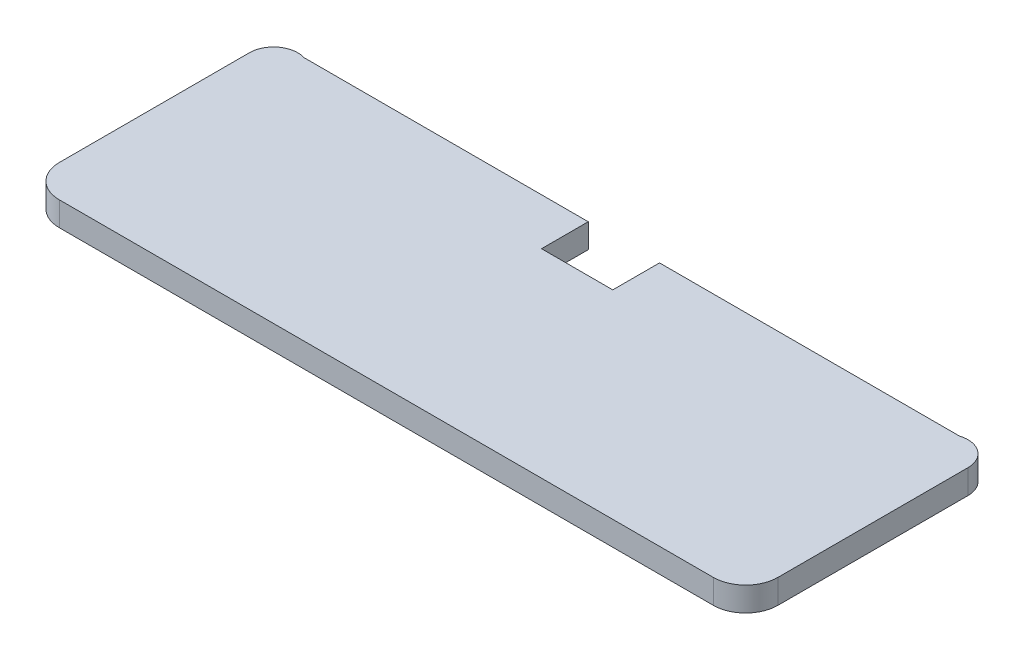
ISO-10303-21;
HEADER;
FILE_DESCRIPTION(('STEP AP214'),'2;1');
FILE_NAME('part.step','',(''),(''),'','','');
FILE_SCHEMA(('AUTOMOTIVE_DESIGN { 1 0 10303 214 1 1 1 1 }'));
ENDSEC;
DATA;
#1=APPLICATION_CONTEXT('core data for automotive mechanical design processes');
#2=APPLICATION_PROTOCOL_DEFINITION('international standard','automotive_design',2000,#1);
#3=PRODUCT_CONTEXT('',#1,'mechanical');
#4=PRODUCT('Part','Part','',(#3));
#5=PRODUCT_RELATED_PRODUCT_CATEGORY('part','',(#4));
#6=PRODUCT_DEFINITION_FORMATION('','',#4);
#7=PRODUCT_DEFINITION_CONTEXT('part definition',#1,'design');
#8=PRODUCT_DEFINITION('design','',#6,#7);
#9=PRODUCT_DEFINITION_SHAPE('','',#8);
#10=(LENGTH_UNIT() NAMED_UNIT(*) SI_UNIT(.MILLI.,.METRE.));
#11=(NAMED_UNIT(*) PLANE_ANGLE_UNIT() SI_UNIT($,.RADIAN.));
#12=(NAMED_UNIT(*) SI_UNIT($,.STERADIAN.) SOLID_ANGLE_UNIT());
#13=UNCERTAINTY_MEASURE_WITH_UNIT(LENGTH_MEASURE(1.E-05),#10,'distance_accuracy_value','');
#14=(GEOMETRIC_REPRESENTATION_CONTEXT(3) GLOBAL_UNCERTAINTY_ASSIGNED_CONTEXT((#13)) GLOBAL_UNIT_ASSIGNED_CONTEXT((#10,
#11,#12)) REPRESENTATION_CONTEXT('',''));
#15=CARTESIAN_POINT('',(0.,0.,0.));
#16=DIRECTION('',(0.,0.,1.));
#17=DIRECTION('',(1.,0.,0.));
#18=AXIS2_PLACEMENT_3D('',#15,#16,#17);
#19=CARTESIAN_POINT('',(37.0635696102086,3.,9.91666470047658));
#20=DIRECTION('',(0.,-1.,0.));
#21=DIRECTION('',(0.,0.,-1.));
#22=AXIS2_PLACEMENT_3D('',#19,#20,#21);
#23=CYLINDRICAL_SURFACE('',#22,4.);
#24=CARTESIAN_POINT('',(37.0635696102086,0.,9.91666470047658));
#25=DIRECTION('',(0.,1.,0.));
#26=DIRECTION('',(0.,0.,-1.));
#27=AXIS2_PLACEMENT_3D('',#24,#25,#26);
#28=CIRCLE('',#27,4.);
#29=CARTESIAN_POINT('',(37.0635696102086,0.,13.9166647004766));
#30=VERTEX_POINT('',#29);
#31=CARTESIAN_POINT('',(41.0635696102086,0.,9.91666470047655));
#32=VERTEX_POINT('',#31);
#33=EDGE_CURVE('E151',#30,#32,#28,.T.);
#34=ORIENTED_EDGE('',*,*,#33,.T.);
#35=DIRECTION('',(0.,-1.,0.));
#36=VECTOR('',#35,1.);
#37=CARTESIAN_POINT('',(41.0635696102086,3.,9.91666470047655));
#38=LINE('',#37,#36);
#39=CARTESIAN_POINT('',(41.0635696102086,3.,9.91666470047655));
#40=VERTEX_POINT('',#39);
#41=EDGE_CURVE('E11',#40,#32,#38,.T.);
#42=ORIENTED_EDGE('',*,*,#41,.F.);
#43=CARTESIAN_POINT('',(37.0635696102086,3.,9.91666470047658));
#44=DIRECTION('',(0.,1.,0.));
#45=DIRECTION('',(0.,0.,-1.));
#46=AXIS2_PLACEMENT_3D('',#43,#44,#45);
#47=CIRCLE('',#46,4.);
#48=CARTESIAN_POINT('',(37.0635696102086,3.,13.9166647004766));
#49=VERTEX_POINT('',#48);
#50=EDGE_CURVE('E174',#49,#40,#47,.T.);
#51=ORIENTED_EDGE('',*,*,#50,.F.);
#52=DIRECTION('',(0.,-1.,0.));
#53=VECTOR('',#52,1.);
#54=CARTESIAN_POINT('',(37.0635696102086,3.,13.9166647004766));
#55=LINE('',#54,#53);
#56=EDGE_CURVE('E147',#49,#30,#55,.T.);
#57=ORIENTED_EDGE('',*,*,#56,.T.);
#58=EDGE_LOOP('',(#34,#42,#51,#57));
#59=FACE_BOUND('',#58,.T.);
#60=ADVANCED_FACE('F32',(#59),#23,.T.);
#61=CARTESIAN_POINT('',(41.0635696102087,3.,-13.6227273136929));
#62=DIRECTION('',(-1.,0.,0.));
#63=DIRECTION('',(0.,0.,1.));
#64=AXIS2_PLACEMENT_3D('',#61,#62,#63);
#65=PLANE('',#64);
#66=DIRECTION('',(0.,0.,-1.));
#67=VECTOR('',#66,1.);
#68=CARTESIAN_POINT('',(41.0635696102087,0.,-13.6227273136929));
#69=LINE('',#68,#67);
#70=CARTESIAN_POINT('',(41.0635696102087,0.,-13.6227273136929));
#71=VERTEX_POINT('',#70);
#72=EDGE_CURVE('E154',#32,#71,#69,.T.);
#73=ORIENTED_EDGE('',*,*,#72,.T.);
#74=DIRECTION('',(0.,-1.,0.));
#75=VECTOR('',#74,1.);
#76=CARTESIAN_POINT('',(41.0635696102087,3.,-13.6227273136929));
#77=LINE('',#76,#75);
#78=CARTESIAN_POINT('',(41.0635696102087,3.,-13.6227273136929));
#79=VERTEX_POINT('',#78);
#80=EDGE_CURVE('E40',#79,#71,#77,.T.);
#81=ORIENTED_EDGE('',*,*,#80,.F.);
#82=DIRECTION('',(0.,0.,-1.));
#83=VECTOR('',#82,1.);
#84=CARTESIAN_POINT('',(41.0635696102086,3.,9.91666470047655));
#85=LINE('',#84,#83);
#86=EDGE_CURVE('E103',#40,#79,#85,.T.);
#87=ORIENTED_EDGE('',*,*,#86,.F.);
#88=ORIENTED_EDGE('',*,*,#41,.T.);
#89=EDGE_LOOP('',(#73,#81,#87,#88));
#90=FACE_BOUND('',#89,.T.);
#91=ADVANCED_FACE('F253',(#90),#65,.F.);
#92=CARTESIAN_POINT('',(38.0635696102087,3.,-13.6227273136929));
#93=DIRECTION('',(0.,-1.,0.));
#94=DIRECTION('',(0.,0.,-1.));
#95=AXIS2_PLACEMENT_3D('',#92,#93,#94);
#96=CYLINDRICAL_SURFACE('',#95,2.99999999999999);
#97=CARTESIAN_POINT('',(38.0635696102087,0.,-13.6227273136929));
#98=DIRECTION('',(0.,1.,0.));
#99=DIRECTION('',(0.,0.,1.));
#100=AXIS2_PLACEMENT_3D('',#97,#98,#99);
#101=CIRCLE('',#100,2.99999999999999);
#102=CARTESIAN_POINT('',(37.1635696102088,0.,-16.4845449179438));
#103=VERTEX_POINT('',#102);
#104=EDGE_CURVE('E156',#71,#103,#101,.T.);
#105=ORIENTED_EDGE('',*,*,#104,.T.);
#106=DIRECTION('',(0.,-1.,0.));
#107=VECTOR('',#106,1.);
#108=CARTESIAN_POINT('',(37.1635696102088,3.,-16.4845449179438));
#109=LINE('',#108,#107);
#110=CARTESIAN_POINT('',(37.1635696102088,3.,-16.4845449179438));
#111=VERTEX_POINT('',#110);
#112=EDGE_CURVE('E193',#111,#103,#109,.T.);
#113=ORIENTED_EDGE('',*,*,#112,.F.);
#114=CARTESIAN_POINT('',(38.0635696102087,3.,-13.6227273136929));
#115=DIRECTION('',(0.,1.,0.));
#116=DIRECTION('',(0.,0.,1.));
#117=AXIS2_PLACEMENT_3D('',#114,#115,#116);
#118=CIRCLE('',#117,2.99999999999999);
#119=EDGE_CURVE('E201',#79,#111,#118,.T.);
#120=ORIENTED_EDGE('',*,*,#119,.F.);
#121=ORIENTED_EDGE('',*,*,#80,.T.);
#122=EDGE_LOOP('',(#105,#113,#120,#121));
#123=FACE_BOUND('',#122,.T.);
#124=ADVANCED_FACE('F199',(#123),#96,.T.);
#125=CARTESIAN_POINT('',(37.1635696102088,3.,-16.4845449179438));
#126=DIRECTION('',(0.,0.,1.));
#127=DIRECTION('',(1.,0.,0.));
#128=AXIS2_PLACEMENT_3D('',#125,#126,#127);
#129=PLANE('',#128);
#130=DIRECTION('',(-1.,0.,0.));
#131=VECTOR('',#130,1.);
#132=CARTESIAN_POINT('',(37.1635696102088,0.,-16.4845449179438));
#133=LINE('',#132,#131);
#134=CARTESIAN_POINT('',(0.,0.,-16.4845449179438));
#135=VERTEX_POINT('',#134);
#136=EDGE_CURVE('E158',#103,#135,#133,.T.);
#137=ORIENTED_EDGE('',*,*,#136,.T.);
#138=DIRECTION('',(0.,-1.,0.));
#139=VECTOR('',#138,1.);
#140=CARTESIAN_POINT('',(0.,3.,-16.4845449179438));
#141=LINE('',#140,#139);
#142=CARTESIAN_POINT('',(0.,3.,-16.4845449179438));
#143=VERTEX_POINT('',#142);
#144=EDGE_CURVE('E190',#143,#135,#141,.T.);
#145=ORIENTED_EDGE('',*,*,#144,.F.);
#146=DIRECTION('',(-1.,0.,0.));
#147=VECTOR('',#146,1.);
#148=CARTESIAN_POINT('',(37.1635696102088,3.,-16.4845449179438));
#149=LINE('',#148,#147);
#150=EDGE_CURVE('E219',#111,#143,#149,.T.);
#151=ORIENTED_EDGE('',*,*,#150,.F.);
#152=ORIENTED_EDGE('',*,*,#112,.T.);
#153=EDGE_LOOP('',(#137,#145,#151,#152));
#154=FACE_BOUND('',#153,.T.);
#155=ADVANCED_FACE('F210',(#154),#129,.F.);
#156=CARTESIAN_POINT('',(0.,3.,-16.4845449179438));
#157=DIRECTION('',(1.,0.,0.));
#158=DIRECTION('',(0.,0.,-1.));
#159=AXIS2_PLACEMENT_3D('',#156,#157,#158);
#160=PLANE('',#159);
#161=DIRECTION('',(0.,0.,1.));
#162=VECTOR('',#161,1.);
#163=CARTESIAN_POINT('',(0.,0.,-16.4845449179438));
#164=LINE('',#163,#162);
#165=CARTESIAN_POINT('',(0.,0.,-10.6950687101346));
#166=VERTEX_POINT('',#165);
#167=EDGE_CURVE('E160',#135,#166,#164,.T.);
#168=ORIENTED_EDGE('',*,*,#167,.T.);
#169=DIRECTION('',(0.,-1.,0.));
#170=VECTOR('',#169,1.);
#171=CARTESIAN_POINT('',(0.,3.,-10.6950687101346));
#172=LINE('',#171,#170);
#173=CARTESIAN_POINT('',(0.,3.,-10.6950687101346));
#174=VERTEX_POINT('',#173);
#175=EDGE_CURVE('E187',#174,#166,#172,.T.);
#176=ORIENTED_EDGE('',*,*,#175,.F.);
#177=DIRECTION('',(0.,0.,1.));
#178=VECTOR('',#177,1.);
#179=CARTESIAN_POINT('',(0.,3.,-16.4845449179438));
#180=LINE('',#179,#178);
#181=EDGE_CURVE('E216',#143,#174,#180,.T.);
#182=ORIENTED_EDGE('',*,*,#181,.F.);
#183=ORIENTED_EDGE('',*,*,#144,.T.);
#184=EDGE_LOOP('',(#168,#176,#182,#183));
#185=FACE_BOUND('',#184,.T.);
#186=ADVANCED_FACE('F214',(#185),#160,.F.);
#187=CARTESIAN_POINT('',(0.,3.,-10.6950687101346));
#188=DIRECTION('',(0.,0.,1.));
#189=DIRECTION('',(1.,0.,0.));
#190=AXIS2_PLACEMENT_3D('',#187,#188,#189);
#191=PLANE('',#190);
#192=DIRECTION('',(-1.,0.,0.));
#193=VECTOR('',#192,1.);
#194=CARTESIAN_POINT('',(0.,0.,-10.6950687101346));
#195=LINE('',#194,#193);
#196=CARTESIAN_POINT('',(-8.82769136105566,0.,-10.6950687101346));
#197=VERTEX_POINT('',#196);
#198=EDGE_CURVE('E162',#166,#197,#195,.T.);
#199=ORIENTED_EDGE('',*,*,#198,.T.);
#200=DIRECTION('',(0.,-1.,0.));
#201=VECTOR('',#200,1.);
#202=CARTESIAN_POINT('',(-8.82769136105566,3.,-10.6950687101346));
#203=LINE('',#202,#201);
#204=CARTESIAN_POINT('',(-8.82769136105566,3.,-10.6950687101346));
#205=VERTEX_POINT('',#204);
#206=EDGE_CURVE('E184',#205,#197,#203,.T.);
#207=ORIENTED_EDGE('',*,*,#206,.F.);
#208=DIRECTION('',(-1.,0.,0.));
#209=VECTOR('',#208,1.);
#210=CARTESIAN_POINT('',(0.,3.,-10.6950687101346));
#211=LINE('',#210,#209);
#212=EDGE_CURVE('E218',#174,#205,#211,.T.);
#213=ORIENTED_EDGE('',*,*,#212,.F.);
#214=ORIENTED_EDGE('',*,*,#175,.T.);
#215=EDGE_LOOP('',(#199,#207,#213,#214));
#216=FACE_BOUND('',#215,.T.);
#217=ADVANCED_FACE('F266',(#216),#191,.F.);
#218=CARTESIAN_POINT('',(-8.82769136105566,3.,-16.4845449179438));
#219=DIRECTION('',(-1.,0.,0.));
#220=DIRECTION('',(0.,0.,1.));
#221=AXIS2_PLACEMENT_3D('',#218,#219,#220);
#222=PLANE('',#221);
#223=DIRECTION('',(0.,0.,-1.));
#224=VECTOR('',#223,1.);
#225=CARTESIAN_POINT('',(-8.82769136105566,0.,-16.4845449179438));
#226=LINE('',#225,#224);
#227=CARTESIAN_POINT('',(-8.82769136105566,0.,-16.4845449179438));
#228=VERTEX_POINT('',#227);
#229=EDGE_CURVE('E164',#197,#228,#226,.T.);
#230=ORIENTED_EDGE('',*,*,#229,.T.);
#231=DIRECTION('',(0.,-1.,0.));
#232=VECTOR('',#231,1.);
#233=CARTESIAN_POINT('',(-8.82769136105566,3.,-16.4845449179438));
#234=LINE('',#233,#232);
#235=CARTESIAN_POINT('',(-8.82769136105566,3.,-16.4845449179438));
#236=VERTEX_POINT('',#235);
#237=EDGE_CURVE('E181',#236,#228,#234,.T.);
#238=ORIENTED_EDGE('',*,*,#237,.F.);
#239=DIRECTION('',(0.,0.,-1.));
#240=VECTOR('',#239,1.);
#241=CARTESIAN_POINT('',(-8.82769136105566,3.,-16.4845449179438));
#242=LINE('',#241,#240);
#243=EDGE_CURVE('E221',#205,#236,#242,.T.);
#244=ORIENTED_EDGE('',*,*,#243,.F.);
#245=ORIENTED_EDGE('',*,*,#206,.T.);
#246=EDGE_LOOP('',(#230,#238,#244,#245));
#247=FACE_BOUND('',#246,.T.);
#248=ADVANCED_FACE('F269',(#247),#222,.F.);
#249=CARTESIAN_POINT('',(-8.82769136105566,3.,-16.4845449179438));
#250=DIRECTION('',(0.,0.,1.));
#251=DIRECTION('',(1.,0.,0.));
#252=AXIS2_PLACEMENT_3D('',#249,#250,#251);
#253=PLANE('',#252);
#254=DIRECTION('',(-1.,0.,0.));
#255=VECTOR('',#254,1.);
#256=CARTESIAN_POINT('',(-8.82769136105566,0.,-16.4845449179438));
#257=LINE('',#256,#255);
#258=CARTESIAN_POINT('',(-44.0364303897915,0.,-16.4845449179438));
#259=VERTEX_POINT('',#258);
#260=EDGE_CURVE('E166',#228,#259,#257,.T.);
#261=ORIENTED_EDGE('',*,*,#260,.T.);
#262=DIRECTION('',(0.,-1.,0.));
#263=VECTOR('',#262,1.);
#264=CARTESIAN_POINT('',(-44.0364303897915,3.,-16.4845449179438));
#265=LINE('',#264,#263);
#266=CARTESIAN_POINT('',(-44.0364303897915,3.,-16.4845449179438));
#267=VERTEX_POINT('',#266);
#268=EDGE_CURVE('E178',#267,#259,#265,.T.);
#269=ORIENTED_EDGE('',*,*,#268,.F.);
#270=DIRECTION('',(-1.,0.,0.));
#271=VECTOR('',#270,1.);
#272=CARTESIAN_POINT('',(-8.82769136105566,3.,-16.4845449179438));
#273=LINE('',#272,#271);
#274=EDGE_CURVE('E227',#236,#267,#273,.T.);
#275=ORIENTED_EDGE('',*,*,#274,.F.);
#276=ORIENTED_EDGE('',*,*,#237,.T.);
#277=EDGE_LOOP('',(#261,#269,#275,#276));
#278=FACE_BOUND('',#277,.T.);
#279=ADVANCED_FACE('F233',(#278),#253,.F.);
#280=CARTESIAN_POINT('',(-44.9364303897914,3.,-13.6227273136929));
#281=DIRECTION('',(0.,-1.,0.));
#282=DIRECTION('',(0.,0.,-1.));
#283=AXIS2_PLACEMENT_3D('',#280,#281,#282);
#284=CYLINDRICAL_SURFACE('',#283,2.99999999999999);
#285=CARTESIAN_POINT('',(-44.9364303897914,0.,-13.6227273136929));
#286=DIRECTION('',(0.,1.,0.));
#287=DIRECTION('',(0.,0.,-1.));
#288=AXIS2_PLACEMENT_3D('',#285,#286,#287);
#289=CIRCLE('',#288,2.99999999999999);
#290=CARTESIAN_POINT('',(-47.9364303897914,0.,-13.6227273136929));
#291=VERTEX_POINT('',#290);
#292=EDGE_CURVE('E168',#259,#291,#289,.T.);
#293=ORIENTED_EDGE('',*,*,#292,.T.);
#294=DIRECTION('',(0.,-1.,0.));
#295=VECTOR('',#294,1.);
#296=CARTESIAN_POINT('',(-47.9364303897914,3.,-13.6227273136929));
#297=LINE('',#296,#295);
#298=CARTESIAN_POINT('',(-47.9364303897914,3.,-13.6227273136929));
#299=VERTEX_POINT('',#298);
#300=EDGE_CURVE('E142',#299,#291,#297,.T.);
#301=ORIENTED_EDGE('',*,*,#300,.F.);
#302=CARTESIAN_POINT('',(-44.9364303897914,3.,-13.6227273136929));
#303=DIRECTION('',(0.,1.,0.));
#304=DIRECTION('',(0.,0.,-1.));
#305=AXIS2_PLACEMENT_3D('',#302,#303,#304);
#306=CIRCLE('',#305,2.99999999999999);
#307=EDGE_CURVE('E134',#267,#299,#306,.T.);
#308=ORIENTED_EDGE('',*,*,#307,.F.);
#309=ORIENTED_EDGE('',*,*,#268,.T.);
#310=EDGE_LOOP('',(#293,#301,#308,#309));
#311=FACE_BOUND('',#310,.T.);
#312=ADVANCED_FACE('F237',(#311),#284,.T.);
#313=CARTESIAN_POINT('',(-47.9364303897913,3.,9.91666470047656));
#314=DIRECTION('',(1.,0.,0.));
#315=DIRECTION('',(0.,0.,-1.));
#316=AXIS2_PLACEMENT_3D('',#313,#314,#315);
#317=PLANE('',#316);
#318=DIRECTION('',(0.,0.,1.));
#319=VECTOR('',#318,1.);
#320=CARTESIAN_POINT('',(-47.9364303897913,0.,9.91666470047656));
#321=LINE('',#320,#319);
#322=CARTESIAN_POINT('',(-47.9364303897913,0.,9.91666470047656));
#323=VERTEX_POINT('',#322);
#324=EDGE_CURVE('E141',#291,#323,#321,.T.);
#325=ORIENTED_EDGE('',*,*,#324,.T.);
#326=DIRECTION('',(0.,-1.,0.));
#327=VECTOR('',#326,1.);
#328=CARTESIAN_POINT('',(-47.9364303897913,3.,9.91666470047656));
#329=LINE('',#328,#327);
#330=CARTESIAN_POINT('',(-47.9364303897913,3.,9.91666470047656));
#331=VERTEX_POINT('',#330);
#332=EDGE_CURVE('E139',#331,#323,#329,.T.);
#333=ORIENTED_EDGE('',*,*,#332,.F.);
#334=DIRECTION('',(0.,0.,1.));
#335=VECTOR('',#334,1.);
#336=CARTESIAN_POINT('',(-47.9364303897914,3.,-13.6227273136929));
#337=LINE('',#336,#335);
#338=EDGE_CURVE('E128',#299,#331,#337,.T.);
#339=ORIENTED_EDGE('',*,*,#338,.F.);
#340=ORIENTED_EDGE('',*,*,#300,.T.);
#341=EDGE_LOOP('',(#325,#333,#339,#340));
#342=FACE_BOUND('',#341,.T.);
#343=ADVANCED_FACE('F140',(#342),#317,.F.);
#344=CARTESIAN_POINT('',(-43.9364303897913,3.,9.91666470047659));
#345=DIRECTION('',(0.,-1.,0.));
#346=DIRECTION('',(0.,0.,-1.));
#347=AXIS2_PLACEMENT_3D('',#344,#345,#346);
#348=CYLINDRICAL_SURFACE('',#347,4.);
#349=CARTESIAN_POINT('',(-43.9364303897913,0.,9.91666470047659));
#350=DIRECTION('',(0.,1.,0.));
#351=DIRECTION('',(0.,0.,1.));
#352=AXIS2_PLACEMENT_3D('',#349,#350,#351);
#353=CIRCLE('',#352,4.);
#354=CARTESIAN_POINT('',(-43.9364303897913,0.,13.9166647004766));
#355=VERTEX_POINT('',#354);
#356=EDGE_CURVE('E89',#323,#355,#353,.T.);
#357=ORIENTED_EDGE('',*,*,#356,.T.);
#358=DIRECTION('',(0.,-1.,0.));
#359=VECTOR('',#358,1.);
#360=CARTESIAN_POINT('',(-43.9364303897913,3.,13.9166647004766));
#361=LINE('',#360,#359);
#362=CARTESIAN_POINT('',(-43.9364303897913,3.,13.9166647004766));
#363=VERTEX_POINT('',#362);
#364=EDGE_CURVE('E143',#363,#355,#361,.T.);
#365=ORIENTED_EDGE('',*,*,#364,.F.);
#366=CARTESIAN_POINT('',(-43.9364303897913,3.,9.91666470047659));
#367=DIRECTION('',(0.,1.,0.));
#368=DIRECTION('',(0.,0.,1.));
#369=AXIS2_PLACEMENT_3D('',#366,#367,#368);
#370=CIRCLE('',#369,4.);
#371=EDGE_CURVE('E132',#331,#363,#370,.T.);
#372=ORIENTED_EDGE('',*,*,#371,.F.);
#373=ORIENTED_EDGE('',*,*,#332,.T.);
#374=EDGE_LOOP('',(#357,#365,#372,#373));
#375=FACE_BOUND('',#374,.T.);
#376=ADVANCED_FACE('F145',(#375),#348,.T.);
#377=CARTESIAN_POINT('',(37.0635696102086,3.,13.9166647004766));
#378=DIRECTION('',(0.,0.,-1.));
#379=DIRECTION('',(-1.,0.,0.));
#380=AXIS2_PLACEMENT_3D('',#377,#378,#379);
#381=PLANE('',#380);
#382=DIRECTION('',(1.,0.,0.));
#383=VECTOR('',#382,1.);
#384=CARTESIAN_POINT('',(37.0635696102086,0.,13.9166647004766));
#385=LINE('',#384,#383);
#386=EDGE_CURVE('E95',#355,#30,#385,.T.);
#387=ORIENTED_EDGE('',*,*,#386,.T.);
#388=ORIENTED_EDGE('',*,*,#56,.F.);
#389=DIRECTION('',(1.,0.,0.));
#390=VECTOR('',#389,1.);
#391=CARTESIAN_POINT('',(37.0635696102086,3.,13.9166647004766));
#392=LINE('',#391,#390);
#393=EDGE_CURVE('E48',#363,#49,#392,.T.);
#394=ORIENTED_EDGE('',*,*,#393,.F.);
#395=ORIENTED_EDGE('',*,*,#364,.T.);
#396=EDGE_LOOP('',(#387,#388,#394,#395));
#397=FACE_BOUND('',#396,.T.);
#398=ADVANCED_FACE('F242',(#397),#381,.F.);
#399=CARTESIAN_POINT('',(37.0635696102086,3.,9.91666470047658));
#400=DIRECTION('',(0.,-1.,0.));
#401=DIRECTION('',(0.,0.,-1.));
#402=AXIS2_PLACEMENT_3D('',#399,#400,#401);
#403=PLANE('',#402);
#404=ORIENTED_EDGE('',*,*,#50,.T.);
#405=ORIENTED_EDGE('',*,*,#86,.T.);
#406=ORIENTED_EDGE('',*,*,#119,.T.);
#407=ORIENTED_EDGE('',*,*,#150,.T.);
#408=ORIENTED_EDGE('',*,*,#181,.T.);
#409=ORIENTED_EDGE('',*,*,#212,.T.);
#410=ORIENTED_EDGE('',*,*,#243,.T.);
#411=ORIENTED_EDGE('',*,*,#274,.T.);
#412=ORIENTED_EDGE('',*,*,#307,.T.);
#413=ORIENTED_EDGE('',*,*,#338,.T.);
#414=ORIENTED_EDGE('',*,*,#371,.T.);
#415=ORIENTED_EDGE('',*,*,#393,.T.);
#416=EDGE_LOOP('',(#404,#405,#406,#407,#408,#409,#410,#411,#412,#413,#414,#415));
#417=FACE_BOUND('',#416,.T.);
#418=ADVANCED_FACE('F130',(#417),#403,.F.);
#419=CARTESIAN_POINT('',(37.0635696102086,0.,9.91666470047658));
#420=DIRECTION('',(0.,-1.,0.));
#421=DIRECTION('',(0.,0.,-1.));
#422=AXIS2_PLACEMENT_3D('',#419,#420,#421);
#423=PLANE('',#422);
#424=ORIENTED_EDGE('',*,*,#33,.F.);
#425=ORIENTED_EDGE('',*,*,#386,.F.);
#426=ORIENTED_EDGE('',*,*,#356,.F.);
#427=ORIENTED_EDGE('',*,*,#324,.F.);
#428=ORIENTED_EDGE('',*,*,#292,.F.);
#429=ORIENTED_EDGE('',*,*,#260,.F.);
#430=ORIENTED_EDGE('',*,*,#229,.F.);
#431=ORIENTED_EDGE('',*,*,#198,.F.);
#432=ORIENTED_EDGE('',*,*,#167,.F.);
#433=ORIENTED_EDGE('',*,*,#136,.F.);
#434=ORIENTED_EDGE('',*,*,#104,.F.);
#435=ORIENTED_EDGE('',*,*,#72,.F.);
#436=EDGE_LOOP('',(#424,#425,#426,#427,#428,#429,#430,#431,#432,#433,#434,#435));
#437=FACE_BOUND('',#436,.T.);
#438=ADVANCED_FACE('F205',(#437),#423,.T.);
#439=CLOSED_SHELL('',(#60,#91,#124,#155,#186,#217,#248,#279,#312,#343,#376,#398,#418,#438));
#440=MANIFOLD_SOLID_BREP('B2',#439);
#441=ADVANCED_BREP_SHAPE_REPRESENTATION('',(#18,#440),#14);
#442=SHAPE_DEFINITION_REPRESENTATION(#9,#441);
ENDSEC;
END-ISO-10303-21;
